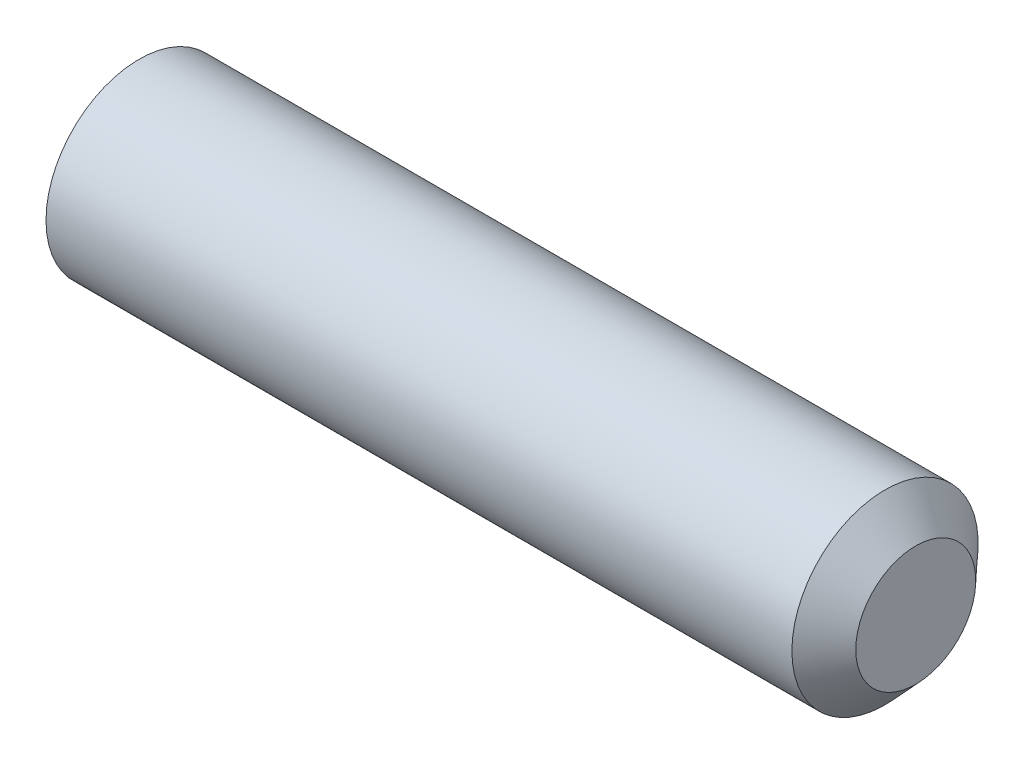
ISO-10303-21;
HEADER;
FILE_DESCRIPTION(('STEP AP214'),'2;1');
FILE_NAME('part.step','',(''),(''),'','','');
FILE_SCHEMA(('AUTOMOTIVE_DESIGN { 1 0 10303 214 1 1 1 1 }'));
ENDSEC;
DATA;
#1=APPLICATION_CONTEXT('core data for automotive mechanical design processes');
#2=APPLICATION_PROTOCOL_DEFINITION('international standard','automotive_design',2000,#1);
#3=PRODUCT_CONTEXT('',#1,'mechanical');
#4=PRODUCT('Part','Part','',(#3));
#5=PRODUCT_RELATED_PRODUCT_CATEGORY('part','',(#4));
#6=PRODUCT_DEFINITION_FORMATION('','',#4);
#7=PRODUCT_DEFINITION_CONTEXT('part definition',#1,'design');
#8=PRODUCT_DEFINITION('design','',#6,#7);
#9=PRODUCT_DEFINITION_SHAPE('','',#8);
#10=(LENGTH_UNIT() NAMED_UNIT(*) SI_UNIT(.MILLI.,.METRE.));
#11=(NAMED_UNIT(*) PLANE_ANGLE_UNIT() SI_UNIT($,.RADIAN.));
#12=(NAMED_UNIT(*) SI_UNIT($,.STERADIAN.) SOLID_ANGLE_UNIT());
#13=UNCERTAINTY_MEASURE_WITH_UNIT(LENGTH_MEASURE(1.E-05),#10,'distance_accuracy_value','');
#14=(GEOMETRIC_REPRESENTATION_CONTEXT(3) GLOBAL_UNCERTAINTY_ASSIGNED_CONTEXT((#13)) GLOBAL_UNIT_ASSIGNED_CONTEXT((#10,
#11,#12)) REPRESENTATION_CONTEXT('',''));
#15=CARTESIAN_POINT('',(0.,0.,0.));
#16=DIRECTION('',(0.,0.,1.));
#17=DIRECTION('',(1.,0.,0.));
#18=AXIS2_PLACEMENT_3D('',#15,#16,#17);
#19=CARTESIAN_POINT('',(-49.75,0.,0.));
#20=DIRECTION('',(1.,0.,0.));
#21=DIRECTION('',(0.,0.,-1.));
#22=AXIS2_PLACEMENT_3D('',#19,#20,#21);
#23=PLANE('',#22);
#24=CARTESIAN_POINT('',(-49.75,0.,0.));
#25=DIRECTION('',(-1.,0.,0.));
#26=DIRECTION('',(0.,0.,1.));
#27=AXIS2_PLACEMENT_3D('',#24,#25,#26);
#28=CIRCLE('',#27,12.425);
#29=CARTESIAN_POINT('',(-49.75,0.,12.425));
#30=VERTEX_POINT('',#29);
#31=EDGE_CURVE('E10',#30,#30,#28,.T.);
#32=ORIENTED_EDGE('',*,*,#31,.T.);
#33=EDGE_LOOP('',(#32));
#34=FACE_BOUND('',#33,.T.);
#35=ADVANCED_FACE('F43',(#34),#23,.F.);
#36=CARTESIAN_POINT('',(0.,0.,0.));
#37=DIRECTION('',(-1.,0.,0.));
#38=DIRECTION('',(0.,0.,1.));
#39=AXIS2_PLACEMENT_3D('',#36,#37,#38);
#40=CYLINDRICAL_SURFACE('',#39,12.425);
#41=ORIENTED_EDGE('',*,*,#31,.F.);
#42=EDGE_LOOP('',(#41));
#43=FACE_BOUND('',#42,.T.);
#44=CARTESIAN_POINT('',(49.75,0.,0.));
#45=DIRECTION('',(-1.,0.,0.));
#46=DIRECTION('',(0.,0.,1.));
#47=AXIS2_PLACEMENT_3D('',#44,#45,#46);
#48=CIRCLE('',#47,12.425);
#49=CARTESIAN_POINT('',(49.75,0.,12.425));
#50=VERTEX_POINT('',#49);
#51=EDGE_CURVE('E50',#50,#50,#48,.T.);
#52=ORIENTED_EDGE('',*,*,#51,.T.);
#53=EDGE_LOOP('',(#52));
#54=FACE_BOUND('',#53,.T.);
#55=ADVANCED_FACE('F71',(#43,#54),#40,.T.);
#56=CARTESIAN_POINT('',(53.85,0.,0.));
#57=DIRECTION('',(-1.,0.,0.));
#58=DIRECTION('',(0.,0.,1.));
#59=AXIS2_PLACEMENT_3D('',#56,#57,#58);
#60=CONICAL_SURFACE('',#59,8.,0.82350287754457);
#61=ORIENTED_EDGE('',*,*,#51,.F.);
#62=EDGE_LOOP('',(#61));
#63=FACE_BOUND('',#62,.T.);
#64=CARTESIAN_POINT('',(53.85,0.,0.));
#65=DIRECTION('',(-1.,0.,0.));
#66=DIRECTION('',(0.,0.,1.));
#67=AXIS2_PLACEMENT_3D('',#64,#65,#66);
#68=CIRCLE('',#67,8.);
#69=CARTESIAN_POINT('',(53.85,0.,8.));
#70=VERTEX_POINT('',#69);
#71=EDGE_CURVE('E55',#70,#70,#68,.T.);
#72=ORIENTED_EDGE('',*,*,#71,.T.);
#73=EDGE_LOOP('',(#72));
#74=FACE_BOUND('',#73,.T.);
#75=ADVANCED_FACE('F63',(#63,#74),#60,.T.);
#76=CARTESIAN_POINT('',(53.85,0.,-8.));
#77=DIRECTION('',(-1.,0.,0.));
#78=DIRECTION('',(0.,0.,1.));
#79=AXIS2_PLACEMENT_3D('',#76,#77,#78);
#80=PLANE('',#79);
#81=ORIENTED_EDGE('',*,*,#71,.F.);
#82=EDGE_LOOP('',(#81));
#83=FACE_BOUND('',#82,.T.);
#84=ADVANCED_FACE('F65',(#83),#80,.F.);
#85=CLOSED_SHELL('',(#35,#55,#75,#84));
#86=MANIFOLD_SOLID_BREP('B2',#85);
#87=ADVANCED_BREP_SHAPE_REPRESENTATION('',(#18,#86),#14);
#88=SHAPE_DEFINITION_REPRESENTATION(#9,#87);
ENDSEC;
END-ISO-10303-21;
